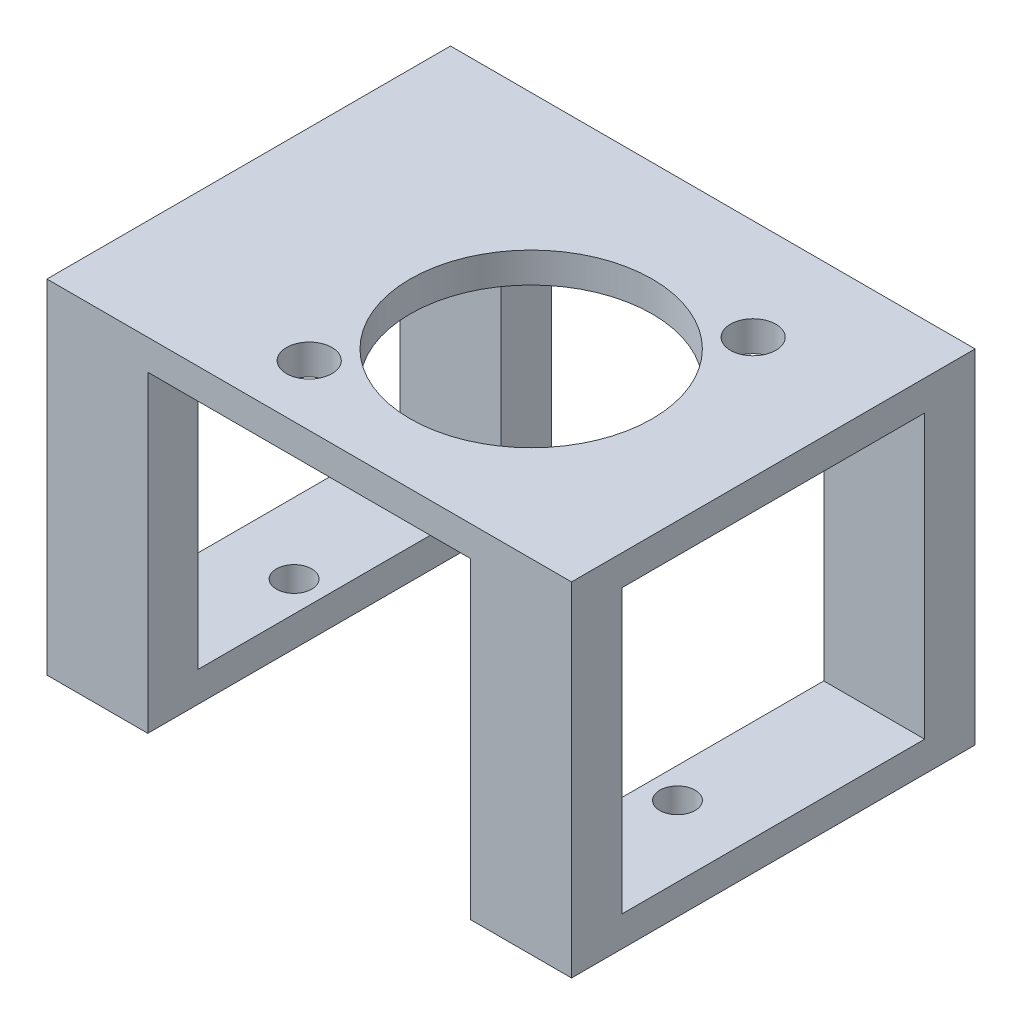
ISO-10303-21;
HEADER;
FILE_DESCRIPTION(('STEP AP214'),'2;1');
FILE_NAME('part.step','',(''),(''),'','','');
FILE_SCHEMA(('AUTOMOTIVE_DESIGN { 1 0 10303 214 1 1 1 1 }'));
ENDSEC;
DATA;
#1=APPLICATION_CONTEXT('core data for automotive mechanical design processes');
#2=APPLICATION_PROTOCOL_DEFINITION('international standard','automotive_design',2000,#1);
#3=PRODUCT_CONTEXT('',#1,'mechanical');
#4=PRODUCT('Part','Part','',(#3));
#5=PRODUCT_RELATED_PRODUCT_CATEGORY('part','',(#4));
#6=PRODUCT_DEFINITION_FORMATION('','',#4);
#7=PRODUCT_DEFINITION_CONTEXT('part definition',#1,'design');
#8=PRODUCT_DEFINITION('design','',#6,#7);
#9=PRODUCT_DEFINITION_SHAPE('','',#8);
#10=(LENGTH_UNIT() NAMED_UNIT(*) SI_UNIT(.MILLI.,.METRE.));
#11=(NAMED_UNIT(*) PLANE_ANGLE_UNIT() SI_UNIT($,.RADIAN.));
#12=(NAMED_UNIT(*) SI_UNIT($,.STERADIAN.) SOLID_ANGLE_UNIT());
#13=UNCERTAINTY_MEASURE_WITH_UNIT(LENGTH_MEASURE(1.E-05),#10,'distance_accuracy_value','');
#14=(GEOMETRIC_REPRESENTATION_CONTEXT(3) GLOBAL_UNCERTAINTY_ASSIGNED_CONTEXT((#13)) GLOBAL_UNIT_ASSIGNED_CONTEXT((#10,
#11,#12)) REPRESENTATION_CONTEXT('',''));
#15=CARTESIAN_POINT('',(0.,0.,0.));
#16=DIRECTION('',(0.,0.,1.));
#17=DIRECTION('',(1.,0.,0.));
#18=AXIS2_PLACEMENT_3D('',#15,#16,#17);
#19=CARTESIAN_POINT('',(0.,31.,0.));
#20=DIRECTION('',(0.,1.,0.));
#21=DIRECTION('',(0.,0.,1.));
#22=AXIS2_PLACEMENT_3D('',#19,#20,#21);
#23=PLANE('',#22);
#24=CARTESIAN_POINT('',(14.,31.,-12.5));
#25=DIRECTION('',(0.,1.,0.));
#26=DIRECTION('',(0.,0.,1.));
#27=AXIS2_PLACEMENT_3D('',#24,#25,#26);
#28=CIRCLE('',#27,2.25);
#29=CARTESIAN_POINT('',(14.,31.,-10.25));
#30=VERTEX_POINT('',#29);
#31=EDGE_CURVE('E237',#30,#30,#28,.F.);
#32=ORIENTED_EDGE('',*,*,#31,.F.);
#33=EDGE_LOOP('',(#32));
#34=FACE_BOUND('',#33,.T.);
#35=CARTESIAN_POINT('',(-6.,31.,11.5));
#36=DIRECTION('',(0.,1.,0.));
#37=DIRECTION('',(0.,0.,1.));
#38=AXIS2_PLACEMENT_3D('',#35,#36,#37);
#39=CIRCLE('',#38,2.25);
#40=CARTESIAN_POINT('',(-6.,31.,13.75));
#41=VERTEX_POINT('',#40);
#42=EDGE_CURVE('E238',#41,#41,#39,.F.);
#43=ORIENTED_EDGE('',*,*,#42,.F.);
#44=EDGE_LOOP('',(#43));
#45=FACE_BOUND('',#44,.T.);
#46=CARTESIAN_POINT('',(4.,31.,-0.499999999999994));
#47=DIRECTION('',(0.,1.,0.));
#48=DIRECTION('',(0.,0.,1.));
#49=AXIS2_PLACEMENT_3D('',#46,#47,#48);
#50=CIRCLE('',#49,12.);
#51=CARTESIAN_POINT('',(4.,31.,11.5));
#52=VERTEX_POINT('',#51);
#53=EDGE_CURVE('E257',#52,#52,#50,.F.);
#54=ORIENTED_EDGE('',*,*,#53,.F.);
#55=EDGE_LOOP('',(#54));
#56=FACE_BOUND('',#55,.T.);
#57=DIRECTION('',(0.,0.,1.));
#58=VECTOR('',#57,1.);
#59=CARTESIAN_POINT('',(16.,31.,17.5));
#60=LINE('',#59,#58);
#61=CARTESIAN_POINT('',(16.,31.,12.5));
#62=VERTEX_POINT('',#61);
#63=CARTESIAN_POINT('',(16.,31.,17.5));
#64=VERTEX_POINT('',#63);
#65=EDGE_CURVE('E157',#62,#64,#60,.T.);
#66=ORIENTED_EDGE('',*,*,#65,.T.);
#67=DIRECTION('',(1.,0.,0.));
#68=VECTOR('',#67,1.);
#69=CARTESIAN_POINT('',(-26.,31.,17.5));
#70=LINE('',#69,#68);
#71=CARTESIAN_POINT('',(-16.,31.,17.5));
#72=VERTEX_POINT('',#71);
#73=EDGE_CURVE('E311',#72,#64,#70,.T.);
#74=ORIENTED_EDGE('',*,*,#73,.F.);
#75=DIRECTION('',(0.,0.,-1.));
#76=VECTOR('',#75,1.);
#77=CARTESIAN_POINT('',(-16.,31.,17.5));
#78=LINE('',#77,#76);
#79=CARTESIAN_POINT('',(-16.,31.,12.5));
#80=VERTEX_POINT('',#79);
#81=EDGE_CURVE('E218',#72,#80,#78,.T.);
#82=ORIENTED_EDGE('',*,*,#81,.T.);
#83=DIRECTION('',(-1.,0.,0.));
#84=VECTOR('',#83,1.);
#85=CARTESIAN_POINT('',(-16.,31.,12.5));
#86=LINE('',#85,#84);
#87=CARTESIAN_POINT('',(-26.,31.,12.5));
#88=VERTEX_POINT('',#87);
#89=EDGE_CURVE('E222',#80,#88,#86,.T.);
#90=ORIENTED_EDGE('',*,*,#89,.T.);
#91=DIRECTION('',(0.,0.,1.));
#92=VECTOR('',#91,1.);
#93=CARTESIAN_POINT('',(-26.,31.,-22.5));
#94=LINE('',#93,#92);
#95=CARTESIAN_POINT('',(-26.,31.,-17.5));
#96=VERTEX_POINT('',#95);
#97=EDGE_CURVE('E291',#96,#88,#94,.T.);
#98=ORIENTED_EDGE('',*,*,#97,.F.);
#99=DIRECTION('',(-1.,0.,0.));
#100=VECTOR('',#99,1.);
#101=CARTESIAN_POINT('',(0.,31.,-17.5));
#102=LINE('',#101,#100);
#103=CARTESIAN_POINT('',(-16.,31.,-17.5));
#104=VERTEX_POINT('',#103);
#105=EDGE_CURVE('E324',#104,#96,#102,.T.);
#106=ORIENTED_EDGE('',*,*,#105,.F.);
#107=DIRECTION('',(0.,0.,-1.));
#108=VECTOR('',#107,1.);
#109=CARTESIAN_POINT('',(-16.,31.,0.));
#110=LINE('',#109,#108);
#111=CARTESIAN_POINT('',(-16.,31.,-22.5));
#112=VERTEX_POINT('',#111);
#113=EDGE_CURVE('E328',#104,#112,#110,.T.);
#114=ORIENTED_EDGE('',*,*,#113,.T.);
#115=DIRECTION('',(-1.,0.,0.));
#116=VECTOR('',#115,1.);
#117=CARTESIAN_POINT('',(-26.,31.,-22.5));
#118=LINE('',#117,#116);
#119=CARTESIAN_POINT('',(16.,31.,-22.5));
#120=VERTEX_POINT('',#119);
#121=EDGE_CURVE('E297',#120,#112,#118,.T.);
#122=ORIENTED_EDGE('',*,*,#121,.F.);
#123=DIRECTION('',(0.,0.,-1.));
#124=VECTOR('',#123,1.);
#125=CARTESIAN_POINT('',(16.,31.,0.));
#126=LINE('',#125,#124);
#127=CARTESIAN_POINT('',(16.,31.,-17.5));
#128=VERTEX_POINT('',#127);
#129=EDGE_CURVE('E265',#128,#120,#126,.T.);
#130=ORIENTED_EDGE('',*,*,#129,.F.);
#131=DIRECTION('',(1.,0.,0.));
#132=VECTOR('',#131,1.);
#133=CARTESIAN_POINT('',(0.,31.,-17.5));
#134=LINE('',#133,#132);
#135=CARTESIAN_POINT('',(26.,31.,-17.5));
#136=VERTEX_POINT('',#135);
#137=EDGE_CURVE('E262',#128,#136,#134,.T.);
#138=ORIENTED_EDGE('',*,*,#137,.T.);
#139=DIRECTION('',(0.,0.,-1.));
#140=VECTOR('',#139,1.);
#141=CARTESIAN_POINT('',(26.,31.,-22.5));
#142=LINE('',#141,#140);
#143=CARTESIAN_POINT('',(26.,31.,12.5));
#144=VERTEX_POINT('',#143);
#145=EDGE_CURVE('E177',#144,#136,#142,.T.);
#146=ORIENTED_EDGE('',*,*,#145,.F.);
#147=DIRECTION('',(-1.,0.,0.));
#148=VECTOR('',#147,1.);
#149=CARTESIAN_POINT('',(16.,31.,12.5));
#150=LINE('',#149,#148);
#151=EDGE_CURVE('E168',#144,#62,#150,.T.);
#152=ORIENTED_EDGE('',*,*,#151,.T.);
#153=EDGE_LOOP('',(#66,#74,#82,#90,#98,#106,#114,#122,#130,#138,#146,#152));
#154=FACE_BOUND('',#153,.T.);
#155=ADVANCED_FACE('F46',(#34,#45,#56,#154),#23,.F.);
#156=CARTESIAN_POINT('',(0.,3.,0.));
#157=DIRECTION('',(0.,1.,0.));
#158=DIRECTION('',(0.,0.,1.));
#159=AXIS2_PLACEMENT_3D('',#156,#157,#158);
#160=PLANE('',#159);
#161=CARTESIAN_POINT('',(19.,3.,0.));
#162=DIRECTION('',(0.,1.,0.));
#163=DIRECTION('',(0.,0.,1.));
#164=AXIS2_PLACEMENT_3D('',#161,#162,#163);
#165=CIRCLE('',#164,1.75);
#166=CARTESIAN_POINT('',(19.,3.,1.75));
#167=VERTEX_POINT('',#166);
#168=EDGE_CURVE('E189',#167,#167,#165,.T.);
#169=ORIENTED_EDGE('',*,*,#168,.F.);
#170=EDGE_LOOP('',(#169));
#171=FACE_BOUND('',#170,.T.);
#172=DIRECTION('',(0.,0.,-1.));
#173=VECTOR('',#172,1.);
#174=CARTESIAN_POINT('',(16.,3.,0.));
#175=LINE('',#174,#173);
#176=CARTESIAN_POINT('',(16.,3.,12.5));
#177=VERTEX_POINT('',#176);
#178=CARTESIAN_POINT('',(16.,3.,-17.5));
#179=VERTEX_POINT('',#178);
#180=EDGE_CURVE('E194',#177,#179,#175,.T.);
#181=ORIENTED_EDGE('',*,*,#180,.F.);
#182=DIRECTION('',(-1.,0.,0.));
#183=VECTOR('',#182,1.);
#184=CARTESIAN_POINT('',(16.,3.,12.5));
#185=LINE('',#184,#183);
#186=CARTESIAN_POINT('',(26.,3.,12.5));
#187=VERTEX_POINT('',#186);
#188=EDGE_CURVE('E172',#187,#177,#185,.T.);
#189=ORIENTED_EDGE('',*,*,#188,.F.);
#190=DIRECTION('',(0.,0.,-1.));
#191=VECTOR('',#190,1.);
#192=CARTESIAN_POINT('',(26.,3.,0.));
#193=LINE('',#192,#191);
#194=CARTESIAN_POINT('',(26.,3.,-17.5));
#195=VERTEX_POINT('',#194);
#196=EDGE_CURVE('E197',#187,#195,#193,.T.);
#197=ORIENTED_EDGE('',*,*,#196,.T.);
#198=DIRECTION('',(1.,0.,0.));
#199=VECTOR('',#198,1.);
#200=CARTESIAN_POINT('',(0.,3.,-17.5));
#201=LINE('',#200,#199);
#202=EDGE_CURVE('E200',#179,#195,#201,.T.);
#203=ORIENTED_EDGE('',*,*,#202,.F.);
#204=EDGE_LOOP('',(#181,#189,#197,#203));
#205=FACE_BOUND('',#204,.T.);
#206=ADVANCED_FACE('F407',(#171,#205),#160,.T.);
#207=CARTESIAN_POINT('',(0.,3.,0.));
#208=DIRECTION('',(0.,1.,0.));
#209=DIRECTION('',(0.,0.,1.));
#210=AXIS2_PLACEMENT_3D('',#207,#208,#209);
#211=PLANE('',#210);
#212=CARTESIAN_POINT('',(-19.,3.,0.));
#213=DIRECTION('',(0.,1.,0.));
#214=DIRECTION('',(0.,0.,1.));
#215=AXIS2_PLACEMENT_3D('',#212,#213,#214);
#216=CIRCLE('',#215,1.75);
#217=CARTESIAN_POINT('',(-19.,3.,1.75000000000001));
#218=VERTEX_POINT('',#217);
#219=EDGE_CURVE('E226',#218,#218,#216,.T.);
#220=ORIENTED_EDGE('',*,*,#219,.F.);
#221=EDGE_LOOP('',(#220));
#222=FACE_BOUND('',#221,.T.);
#223=DIRECTION('',(0.,0.,-1.));
#224=VECTOR('',#223,1.);
#225=CARTESIAN_POINT('',(-26.,3.,0.));
#226=LINE('',#225,#224);
#227=CARTESIAN_POINT('',(-26.,3.,12.5));
#228=VERTEX_POINT('',#227);
#229=CARTESIAN_POINT('',(-26.,3.,-17.5));
#230=VERTEX_POINT('',#229);
#231=EDGE_CURVE('E352',#228,#230,#226,.T.);
#232=ORIENTED_EDGE('',*,*,#231,.F.);
#233=DIRECTION('',(-1.,0.,0.));
#234=VECTOR('',#233,1.);
#235=CARTESIAN_POINT('',(-16.,3.,12.5));
#236=LINE('',#235,#234);
#237=CARTESIAN_POINT('',(-16.,3.,12.5));
#238=VERTEX_POINT('',#237);
#239=EDGE_CURVE('E209',#238,#228,#236,.T.);
#240=ORIENTED_EDGE('',*,*,#239,.F.);
#241=DIRECTION('',(0.,0.,-1.));
#242=VECTOR('',#241,1.);
#243=CARTESIAN_POINT('',(-16.,3.,0.));
#244=LINE('',#243,#242);
#245=CARTESIAN_POINT('',(-16.,3.,-17.5));
#246=VERTEX_POINT('',#245);
#247=EDGE_CURVE('E355',#238,#246,#244,.T.);
#248=ORIENTED_EDGE('',*,*,#247,.T.);
#249=DIRECTION('',(-1.,0.,0.));
#250=VECTOR('',#249,1.);
#251=CARTESIAN_POINT('',(0.,3.,-17.5));
#252=LINE('',#251,#250);
#253=EDGE_CURVE('E359',#246,#230,#252,.T.);
#254=ORIENTED_EDGE('',*,*,#253,.T.);
#255=EDGE_LOOP('',(#232,#240,#248,#254));
#256=FACE_BOUND('',#255,.T.);
#257=ADVANCED_FACE('F396',(#222,#256),#211,.T.);
#258=CARTESIAN_POINT('',(-26.,3.,0.));
#259=DIRECTION('',(-1.,0.,0.));
#260=DIRECTION('',(0.,0.,1.));
#261=AXIS2_PLACEMENT_3D('',#258,#259,#260);
#262=PLANE('',#261);
#263=DIRECTION('',(0.,-1.,0.));
#264=VECTOR('',#263,1.);
#265=CARTESIAN_POINT('',(-26.,3.,17.5));
#266=LINE('',#265,#264);
#267=CARTESIAN_POINT('',(-26.,34.,17.5));
#268=VERTEX_POINT('',#267);
#269=CARTESIAN_POINT('',(-26.,0.,17.5));
#270=VERTEX_POINT('',#269);
#271=EDGE_CURVE('E11',#268,#270,#266,.T.);
#272=ORIENTED_EDGE('',*,*,#271,.F.);
#273=DIRECTION('',(0.,0.,1.));
#274=VECTOR('',#273,1.);
#275=CARTESIAN_POINT('',(-26.,34.,-22.5));
#276=LINE('',#275,#274);
#277=CARTESIAN_POINT('',(-26.,34.,-22.5));
#278=VERTEX_POINT('',#277);
#279=EDGE_CURVE('E292',#278,#268,#276,.T.);
#280=ORIENTED_EDGE('',*,*,#279,.F.);
#281=DIRECTION('',(0.,-1.,0.));
#282=VECTOR('',#281,1.);
#283=CARTESIAN_POINT('',(-26.,31.,-22.5));
#284=LINE('',#283,#282);
#285=CARTESIAN_POINT('',(-26.,0.,-22.5));
#286=VERTEX_POINT('',#285);
#287=EDGE_CURVE('E332',#278,#286,#284,.T.);
#288=ORIENTED_EDGE('',*,*,#287,.T.);
#289=DIRECTION('',(0.,0.,-1.));
#290=VECTOR('',#289,1.);
#291=CARTESIAN_POINT('',(-26.,0.,0.));
#292=LINE('',#291,#290);
#293=EDGE_CURVE('E351',#270,#286,#292,.T.);
#294=ORIENTED_EDGE('',*,*,#293,.F.);
#295=EDGE_LOOP('',(#272,#280,#288,#294));
#296=FACE_BOUND('',#295,.T.);
#297=ORIENTED_EDGE('',*,*,#97,.T.);
#298=DIRECTION('',(0.,-1.,0.));
#299=VECTOR('',#298,1.);
#300=CARTESIAN_POINT('',(-26.,34.002,12.5));
#301=LINE('',#300,#299);
#302=EDGE_CURVE('E213',#88,#228,#301,.T.);
#303=ORIENTED_EDGE('',*,*,#302,.T.);
#304=ORIENTED_EDGE('',*,*,#231,.T.);
#305=DIRECTION('',(0.,-1.,0.));
#306=VECTOR('',#305,1.);
#307=CARTESIAN_POINT('',(-26.,31.,-17.5));
#308=LINE('',#307,#306);
#309=EDGE_CURVE('E347',#96,#230,#308,.T.);
#310=ORIENTED_EDGE('',*,*,#309,.F.);
#311=EDGE_LOOP('',(#297,#303,#304,#310));
#312=FACE_BOUND('',#311,.T.);
#313=ADVANCED_FACE('F48',(#296,#312),#262,.T.);
#314=CARTESIAN_POINT('',(0.,3.,17.5));
#315=DIRECTION('',(0.,0.,-1.));
#316=DIRECTION('',(-1.,0.,0.));
#317=AXIS2_PLACEMENT_3D('',#314,#315,#316);
#318=PLANE('',#317);
#319=DIRECTION('',(1.,0.,0.));
#320=VECTOR('',#319,1.);
#321=CARTESIAN_POINT('',(0.,0.,17.5));
#322=LINE('',#321,#320);
#323=CARTESIAN_POINT('',(-16.,0.,17.5));
#324=VERTEX_POINT('',#323);
#325=EDGE_CURVE('E365',#270,#324,#322,.T.);
#326=ORIENTED_EDGE('',*,*,#325,.T.);
#327=DIRECTION('',(0.,-1.,0.));
#328=VECTOR('',#327,1.);
#329=CARTESIAN_POINT('',(-16.,3.,17.5));
#330=LINE('',#329,#328);
#331=EDGE_CURVE('E55',#72,#324,#330,.T.);
#332=ORIENTED_EDGE('',*,*,#331,.F.);
#333=ORIENTED_EDGE('',*,*,#73,.T.);
#334=DIRECTION('',(0.,-1.,0.));
#335=VECTOR('',#334,1.);
#336=CARTESIAN_POINT('',(16.,3.,17.5));
#337=LINE('',#336,#335);
#338=CARTESIAN_POINT('',(16.,0.,17.5));
#339=VERTEX_POINT('',#338);
#340=EDGE_CURVE('E162',#64,#339,#337,.T.);
#341=ORIENTED_EDGE('',*,*,#340,.T.);
#342=DIRECTION('',(1.,0.,0.));
#343=VECTOR('',#342,1.);
#344=CARTESIAN_POINT('',(0.,0.,17.5));
#345=LINE('',#344,#343);
#346=CARTESIAN_POINT('',(26.,0.,17.5));
#347=VERTEX_POINT('',#346);
#348=EDGE_CURVE('E193',#339,#347,#345,.T.);
#349=ORIENTED_EDGE('',*,*,#348,.T.);
#350=DIRECTION('',(0.,-1.,0.));
#351=VECTOR('',#350,1.);
#352=CARTESIAN_POINT('',(26.,34.,17.5));
#353=LINE('',#352,#351);
#354=CARTESIAN_POINT('',(26.,34.,17.5));
#355=VERTEX_POINT('',#354);
#356=EDGE_CURVE('E320',#355,#347,#353,.T.);
#357=ORIENTED_EDGE('',*,*,#356,.F.);
#358=DIRECTION('',(1.,0.,0.));
#359=VECTOR('',#358,1.);
#360=CARTESIAN_POINT('',(-26.,34.,17.5));
#361=LINE('',#360,#359);
#362=EDGE_CURVE('E296',#268,#355,#361,.T.);
#363=ORIENTED_EDGE('',*,*,#362,.F.);
#364=ORIENTED_EDGE('',*,*,#271,.T.);
#365=EDGE_LOOP('',(#326,#332,#333,#341,#349,#357,#363,#364));
#366=FACE_BOUND('',#365,.T.);
#367=ADVANCED_FACE('F401',(#366),#318,.F.);
#368=CARTESIAN_POINT('',(-16.,3.,0.));
#369=DIRECTION('',(-1.,0.,0.));
#370=DIRECTION('',(0.,0.,1.));
#371=AXIS2_PLACEMENT_3D('',#368,#369,#370);
#372=PLANE('',#371);
#373=DIRECTION('',(0.,0.,-1.));
#374=VECTOR('',#373,1.);
#375=CARTESIAN_POINT('',(-16.,0.,0.));
#376=LINE('',#375,#374);
#377=CARTESIAN_POINT('',(-16.,0.,-22.5));
#378=VERTEX_POINT('',#377);
#379=EDGE_CURVE('E356',#324,#378,#376,.T.);
#380=ORIENTED_EDGE('',*,*,#379,.T.);
#381=DIRECTION('',(0.,-1.,0.));
#382=VECTOR('',#381,1.);
#383=CARTESIAN_POINT('',(-16.,31.,-22.5));
#384=LINE('',#383,#382);
#385=EDGE_CURVE('E339',#112,#378,#384,.T.);
#386=ORIENTED_EDGE('',*,*,#385,.F.);
#387=ORIENTED_EDGE('',*,*,#113,.F.);
#388=DIRECTION('',(0.,-1.,0.));
#389=VECTOR('',#388,1.);
#390=CARTESIAN_POINT('',(-16.,31.,-17.5));
#391=LINE('',#390,#389);
#392=EDGE_CURVE('E343',#104,#246,#391,.T.);
#393=ORIENTED_EDGE('',*,*,#392,.T.);
#394=ORIENTED_EDGE('',*,*,#247,.F.);
#395=DIRECTION('',(0.,-1.,0.));
#396=VECTOR('',#395,1.);
#397=CARTESIAN_POINT('',(-16.,34.002,12.5));
#398=LINE('',#397,#396);
#399=EDGE_CURVE('E214',#80,#238,#398,.T.);
#400=ORIENTED_EDGE('',*,*,#399,.F.);
#401=ORIENTED_EDGE('',*,*,#81,.F.);
#402=ORIENTED_EDGE('',*,*,#331,.T.);
#403=EDGE_LOOP('',(#380,#386,#387,#393,#394,#400,#401,#402));
#404=FACE_BOUND('',#403,.T.);
#405=ADVANCED_FACE('F374',(#404),#372,.F.);
#406=CARTESIAN_POINT('',(0.,0.,0.));
#407=DIRECTION('',(0.,1.,0.));
#408=DIRECTION('',(0.,0.,1.));
#409=AXIS2_PLACEMENT_3D('',#406,#407,#408);
#410=PLANE('',#409);
#411=CARTESIAN_POINT('',(-19.,0.,0.));
#412=DIRECTION('',(0.,1.,0.));
#413=DIRECTION('',(0.,0.,1.));
#414=AXIS2_PLACEMENT_3D('',#411,#412,#413);
#415=CIRCLE('',#414,1.75);
#416=CARTESIAN_POINT('',(-19.,0.,1.75000000000001));
#417=VERTEX_POINT('',#416);
#418=EDGE_CURVE('E233',#417,#417,#415,.F.);
#419=ORIENTED_EDGE('',*,*,#418,.F.);
#420=EDGE_LOOP('',(#419));
#421=FACE_BOUND('',#420,.T.);
#422=ORIENTED_EDGE('',*,*,#293,.T.);
#423=DIRECTION('',(-1.,0.,0.));
#424=VECTOR('',#423,1.);
#425=CARTESIAN_POINT('',(0.,0.,-22.5));
#426=LINE('',#425,#424);
#427=EDGE_CURVE('E323',#378,#286,#426,.T.);
#428=ORIENTED_EDGE('',*,*,#427,.F.);
#429=ORIENTED_EDGE('',*,*,#379,.F.);
#430=ORIENTED_EDGE('',*,*,#325,.F.);
#431=EDGE_LOOP('',(#422,#428,#429,#430));
#432=FACE_BOUND('',#431,.T.);
#433=ADVANCED_FACE('F381',(#421,#432),#410,.F.);
#434=CARTESIAN_POINT('',(0.,31.,-17.5));
#435=DIRECTION('',(0.,0.,1.));
#436=DIRECTION('',(1.,0.,0.));
#437=AXIS2_PLACEMENT_3D('',#434,#435,#436);
#438=PLANE('',#437);
#439=ORIENTED_EDGE('',*,*,#253,.F.);
#440=ORIENTED_EDGE('',*,*,#392,.F.);
#441=ORIENTED_EDGE('',*,*,#105,.T.);
#442=ORIENTED_EDGE('',*,*,#309,.T.);
#443=EDGE_LOOP('',(#439,#440,#441,#442));
#444=FACE_BOUND('',#443,.T.);
#445=ADVANCED_FACE('F393',(#444),#438,.T.);
#446=CARTESIAN_POINT('',(0.,31.,-22.5));
#447=DIRECTION('',(0.,0.,1.));
#448=DIRECTION('',(1.,0.,0.));
#449=AXIS2_PLACEMENT_3D('',#446,#447,#448);
#450=PLANE('',#449);
#451=ORIENTED_EDGE('',*,*,#427,.T.);
#452=ORIENTED_EDGE('',*,*,#287,.F.);
#453=DIRECTION('',(-1.,0.,0.));
#454=VECTOR('',#453,1.);
#455=CARTESIAN_POINT('',(-26.,34.,-22.5));
#456=LINE('',#455,#454);
#457=CARTESIAN_POINT('',(26.,34.,-22.5));
#458=VERTEX_POINT('',#457);
#459=EDGE_CURVE('E303',#458,#278,#456,.T.);
#460=ORIENTED_EDGE('',*,*,#459,.F.);
#461=DIRECTION('',(0.,-1.,0.));
#462=VECTOR('',#461,1.);
#463=CARTESIAN_POINT('',(26.,34.,-22.5));
#464=LINE('',#463,#462);
#465=CARTESIAN_POINT('',(26.,0.,-22.5));
#466=VERTEX_POINT('',#465);
#467=EDGE_CURVE('E307',#458,#466,#464,.T.);
#468=ORIENTED_EDGE('',*,*,#467,.T.);
#469=DIRECTION('',(1.,0.,0.));
#470=VECTOR('',#469,1.);
#471=CARTESIAN_POINT('',(0.,0.,-22.5));
#472=LINE('',#471,#470);
#473=CARTESIAN_POINT('',(16.,0.,-22.5));
#474=VERTEX_POINT('',#473);
#475=EDGE_CURVE('E274',#474,#466,#472,.T.);
#476=ORIENTED_EDGE('',*,*,#475,.F.);
#477=DIRECTION('',(0.,-1.,0.));
#478=VECTOR('',#477,1.);
#479=CARTESIAN_POINT('',(16.,31.,-22.5));
#480=LINE('',#479,#478);
#481=EDGE_CURVE('E284',#120,#474,#480,.T.);
#482=ORIENTED_EDGE('',*,*,#481,.F.);
#483=ORIENTED_EDGE('',*,*,#121,.T.);
#484=ORIENTED_EDGE('',*,*,#385,.T.);
#485=EDGE_LOOP('',(#451,#452,#460,#468,#476,#482,#483,#484));
#486=FACE_BOUND('',#485,.T.);
#487=ADVANCED_FACE('F384',(#486),#450,.F.);
#488=CARTESIAN_POINT('',(26.,34.,-22.5));
#489=DIRECTION('',(-1.,0.,0.));
#490=DIRECTION('',(0.,0.,1.));
#491=AXIS2_PLACEMENT_3D('',#488,#489,#490);
#492=PLANE('',#491);
#493=DIRECTION('',(0.,-1.,0.));
#494=VECTOR('',#493,1.);
#495=CARTESIAN_POINT('',(26.,34.002,12.5));
#496=LINE('',#495,#494);
#497=EDGE_CURVE('E62',#144,#187,#496,.T.);
#498=ORIENTED_EDGE('',*,*,#497,.F.);
#499=ORIENTED_EDGE('',*,*,#145,.T.);
#500=DIRECTION('',(0.,-1.,0.));
#501=VECTOR('',#500,1.);
#502=CARTESIAN_POINT('',(26.,31.,-17.5));
#503=LINE('',#502,#501);
#504=EDGE_CURVE('E287',#136,#195,#503,.T.);
#505=ORIENTED_EDGE('',*,*,#504,.T.);
#506=ORIENTED_EDGE('',*,*,#196,.F.);
#507=EDGE_LOOP('',(#498,#499,#505,#506));
#508=FACE_BOUND('',#507,.T.);
#509=ORIENTED_EDGE('',*,*,#356,.T.);
#510=DIRECTION('',(0.,0.,-1.));
#511=VECTOR('',#510,1.);
#512=CARTESIAN_POINT('',(26.,0.,0.));
#513=LINE('',#512,#511);
#514=EDGE_CURVE('E261',#347,#466,#513,.T.);
#515=ORIENTED_EDGE('',*,*,#514,.T.);
#516=ORIENTED_EDGE('',*,*,#467,.F.);
#517=DIRECTION('',(0.,0.,-1.));
#518=VECTOR('',#517,1.);
#519=CARTESIAN_POINT('',(26.,34.,-22.5));
#520=LINE('',#519,#518);
#521=EDGE_CURVE('E300',#355,#458,#520,.T.);
#522=ORIENTED_EDGE('',*,*,#521,.F.);
#523=EDGE_LOOP('',(#509,#515,#516,#522));
#524=FACE_BOUND('',#523,.T.);
#525=ADVANCED_FACE('F424',(#508,#524),#492,.F.);
#526=CARTESIAN_POINT('',(0.,34.,0.));
#527=DIRECTION('',(0.,1.,0.));
#528=DIRECTION('',(0.,0.,1.));
#529=AXIS2_PLACEMENT_3D('',#526,#527,#528);
#530=PLANE('',#529);
#531=CARTESIAN_POINT('',(14.,34.,-12.5));
#532=DIRECTION('',(0.,1.,0.));
#533=DIRECTION('',(0.,0.,1.));
#534=AXIS2_PLACEMENT_3D('',#531,#532,#533);
#535=CIRCLE('',#534,2.25);
#536=CARTESIAN_POINT('',(14.,34.,-10.25));
#537=VERTEX_POINT('',#536);
#538=EDGE_CURVE('E243',#537,#537,#535,.T.);
#539=ORIENTED_EDGE('',*,*,#538,.F.);
#540=EDGE_LOOP('',(#539));
#541=FACE_BOUND('',#540,.T.);
#542=CARTESIAN_POINT('',(-6.,34.,11.5));
#543=DIRECTION('',(0.,1.,0.));
#544=DIRECTION('',(0.,0.,1.));
#545=AXIS2_PLACEMENT_3D('',#542,#543,#544);
#546=CIRCLE('',#545,2.25);
#547=CARTESIAN_POINT('',(-6.,34.,13.75));
#548=VERTEX_POINT('',#547);
#549=EDGE_CURVE('E242',#548,#548,#546,.T.);
#550=ORIENTED_EDGE('',*,*,#549,.F.);
#551=EDGE_LOOP('',(#550));
#552=FACE_BOUND('',#551,.T.);
#553=CARTESIAN_POINT('',(4.,34.,-0.499999999999994));
#554=DIRECTION('',(0.,1.,0.));
#555=DIRECTION('',(0.,0.,1.));
#556=AXIS2_PLACEMENT_3D('',#553,#554,#555);
#557=CIRCLE('',#556,12.);
#558=CARTESIAN_POINT('',(4.,34.,11.5));
#559=VERTEX_POINT('',#558);
#560=EDGE_CURVE('E247',#559,#559,#557,.T.);
#561=ORIENTED_EDGE('',*,*,#560,.F.);
#562=EDGE_LOOP('',(#561));
#563=FACE_BOUND('',#562,.T.);
#564=ORIENTED_EDGE('',*,*,#279,.T.);
#565=ORIENTED_EDGE('',*,*,#362,.T.);
#566=ORIENTED_EDGE('',*,*,#521,.T.);
#567=ORIENTED_EDGE('',*,*,#459,.T.);
#568=EDGE_LOOP('',(#564,#565,#566,#567));
#569=FACE_BOUND('',#568,.T.);
#570=ADVANCED_FACE('F422',(#541,#552,#563,#569),#530,.T.);
#571=CARTESIAN_POINT('',(0.,31.,-17.5));
#572=DIRECTION('',(0.,0.,-1.));
#573=DIRECTION('',(-1.,0.,0.));
#574=AXIS2_PLACEMENT_3D('',#571,#572,#573);
#575=PLANE('',#574);
#576=DIRECTION('',(0.,-1.,0.));
#577=VECTOR('',#576,1.);
#578=CARTESIAN_POINT('',(16.,31.,-17.5));
#579=LINE('',#578,#577);
#580=EDGE_CURVE('E270',#128,#179,#579,.T.);
#581=ORIENTED_EDGE('',*,*,#580,.T.);
#582=ORIENTED_EDGE('',*,*,#202,.T.);
#583=ORIENTED_EDGE('',*,*,#504,.F.);
#584=ORIENTED_EDGE('',*,*,#137,.F.);
#585=EDGE_LOOP('',(#581,#582,#583,#584));
#586=FACE_BOUND('',#585,.T.);
#587=ADVANCED_FACE('F464',(#586),#575,.F.);
#588=CARTESIAN_POINT('',(16.,31.,0.));
#589=DIRECTION('',(-1.,0.,0.));
#590=DIRECTION('',(0.,0.,1.));
#591=AXIS2_PLACEMENT_3D('',#588,#589,#590);
#592=PLANE('',#591);
#593=DIRECTION('',(0.,0.,-1.));
#594=VECTOR('',#593,1.);
#595=CARTESIAN_POINT('',(16.,0.,0.));
#596=LINE('',#595,#594);
#597=EDGE_CURVE('E266',#339,#474,#596,.T.);
#598=ORIENTED_EDGE('',*,*,#597,.F.);
#599=ORIENTED_EDGE('',*,*,#340,.F.);
#600=ORIENTED_EDGE('',*,*,#65,.F.);
#601=DIRECTION('',(0.,-1.,0.));
#602=VECTOR('',#601,1.);
#603=CARTESIAN_POINT('',(16.,34.002,12.5));
#604=LINE('',#603,#602);
#605=EDGE_CURVE('E160',#62,#177,#604,.T.);
#606=ORIENTED_EDGE('',*,*,#605,.T.);
#607=ORIENTED_EDGE('',*,*,#180,.T.);
#608=ORIENTED_EDGE('',*,*,#580,.F.);
#609=ORIENTED_EDGE('',*,*,#129,.T.);
#610=ORIENTED_EDGE('',*,*,#481,.T.);
#611=EDGE_LOOP('',(#598,#599,#600,#606,#607,#608,#609,#610));
#612=FACE_BOUND('',#611,.T.);
#613=ADVANCED_FACE('F159',(#612),#592,.T.);
#614=CARTESIAN_POINT('',(0.,0.,0.));
#615=DIRECTION('',(0.,1.,0.));
#616=DIRECTION('',(0.,0.,1.));
#617=AXIS2_PLACEMENT_3D('',#614,#615,#616);
#618=PLANE('',#617);
#619=ORIENTED_EDGE('',*,*,#514,.F.);
#620=ORIENTED_EDGE('',*,*,#348,.F.);
#621=ORIENTED_EDGE('',*,*,#597,.T.);
#622=ORIENTED_EDGE('',*,*,#475,.T.);
#623=EDGE_LOOP('',(#619,#620,#621,#622));
#624=FACE_BOUND('',#623,.T.);
#625=CARTESIAN_POINT('',(19.,0.,0.));
#626=DIRECTION('',(0.,1.,0.));
#627=DIRECTION('',(0.,0.,1.));
#628=AXIS2_PLACEMENT_3D('',#625,#626,#627);
#629=CIRCLE('',#628,1.75);
#630=CARTESIAN_POINT('',(19.,0.,1.75));
#631=VERTEX_POINT('',#630);
#632=EDGE_CURVE('E185',#631,#631,#629,.F.);
#633=ORIENTED_EDGE('',*,*,#632,.F.);
#634=EDGE_LOOP('',(#633));
#635=FACE_BOUND('',#634,.T.);
#636=ADVANCED_FACE('F477',(#624,#635),#618,.F.);
#637=CARTESIAN_POINT('',(4.,-0.001000000000001,-0.499999999999994));
#638=DIRECTION('',(0.,1.,0.));
#639=DIRECTION('',(0.,0.,1.));
#640=AXIS2_PLACEMENT_3D('',#637,#638,#639);
#641=CYLINDRICAL_SURFACE('',#640,12.);
#642=ORIENTED_EDGE('',*,*,#560,.T.);
#643=EDGE_LOOP('',(#642));
#644=FACE_BOUND('',#643,.T.);
#645=ORIENTED_EDGE('',*,*,#53,.T.);
#646=EDGE_LOOP('',(#645));
#647=FACE_BOUND('',#646,.T.);
#648=ADVANCED_FACE('F484',(#644,#647),#641,.F.);
#649=CARTESIAN_POINT('',(-6.,-0.001000000000001,11.5));
#650=DIRECTION('',(0.,1.,0.));
#651=DIRECTION('',(0.,0.,1.));
#652=AXIS2_PLACEMENT_3D('',#649,#650,#651);
#653=CYLINDRICAL_SURFACE('',#652,2.25);
#654=ORIENTED_EDGE('',*,*,#549,.T.);
#655=EDGE_LOOP('',(#654));
#656=FACE_BOUND('',#655,.T.);
#657=ORIENTED_EDGE('',*,*,#42,.T.);
#658=EDGE_LOOP('',(#657));
#659=FACE_BOUND('',#658,.T.);
#660=ADVANCED_FACE('F492',(#656,#659),#653,.F.);
#661=CARTESIAN_POINT('',(14.,-0.001000000000001,-12.5));
#662=DIRECTION('',(0.,1.,0.));
#663=DIRECTION('',(0.,0.,1.));
#664=AXIS2_PLACEMENT_3D('',#661,#662,#663);
#665=CYLINDRICAL_SURFACE('',#664,2.25);
#666=ORIENTED_EDGE('',*,*,#538,.T.);
#667=EDGE_LOOP('',(#666));
#668=FACE_BOUND('',#667,.T.);
#669=ORIENTED_EDGE('',*,*,#31,.T.);
#670=EDGE_LOOP('',(#669));
#671=FACE_BOUND('',#670,.T.);
#672=ADVANCED_FACE('F500',(#668,#671),#665,.F.);
#673=CARTESIAN_POINT('',(-19.,-0.00100000000000013,0.));
#674=DIRECTION('',(0.,1.,0.));
#675=DIRECTION('',(0.,0.,1.));
#676=AXIS2_PLACEMENT_3D('',#673,#674,#675);
#677=CYLINDRICAL_SURFACE('',#676,1.75);
#678=ORIENTED_EDGE('',*,*,#219,.T.);
#679=EDGE_LOOP('',(#678));
#680=FACE_BOUND('',#679,.T.);
#681=ORIENTED_EDGE('',*,*,#418,.T.);
#682=EDGE_LOOP('',(#681));
#683=FACE_BOUND('',#682,.T.);
#684=ADVANCED_FACE('F507',(#680,#683),#677,.F.);
#685=CARTESIAN_POINT('',(-16.,34.002,12.5));
#686=DIRECTION('',(0.,0.,1.));
#687=DIRECTION('',(1.,0.,0.));
#688=AXIS2_PLACEMENT_3D('',#685,#686,#687);
#689=PLANE('',#688);
#690=ORIENTED_EDGE('',*,*,#89,.F.);
#691=ORIENTED_EDGE('',*,*,#399,.T.);
#692=ORIENTED_EDGE('',*,*,#239,.T.);
#693=ORIENTED_EDGE('',*,*,#302,.F.);
#694=EDGE_LOOP('',(#690,#691,#692,#693));
#695=FACE_BOUND('',#694,.T.);
#696=ADVANCED_FACE('F398',(#695),#689,.F.);
#697=CARTESIAN_POINT('',(19.,-0.00100000000000013,0.));
#698=DIRECTION('',(0.,1.,0.));
#699=DIRECTION('',(0.,0.,1.));
#700=AXIS2_PLACEMENT_3D('',#697,#698,#699);
#701=CYLINDRICAL_SURFACE('',#700,1.75);
#702=ORIENTED_EDGE('',*,*,#168,.T.);
#703=EDGE_LOOP('',(#702));
#704=FACE_BOUND('',#703,.T.);
#705=ORIENTED_EDGE('',*,*,#632,.T.);
#706=EDGE_LOOP('',(#705));
#707=FACE_BOUND('',#706,.T.);
#708=ADVANCED_FACE('F520',(#704,#707),#701,.F.);
#709=CARTESIAN_POINT('',(16.,34.002,12.5));
#710=DIRECTION('',(0.,0.,1.));
#711=DIRECTION('',(1.,0.,0.));
#712=AXIS2_PLACEMENT_3D('',#709,#710,#711);
#713=PLANE('',#712);
#714=ORIENTED_EDGE('',*,*,#151,.F.);
#715=ORIENTED_EDGE('',*,*,#497,.T.);
#716=ORIENTED_EDGE('',*,*,#188,.T.);
#717=ORIENTED_EDGE('',*,*,#605,.F.);
#718=EDGE_LOOP('',(#714,#715,#716,#717));
#719=FACE_BOUND('',#718,.T.);
#720=ADVANCED_FACE('F170',(#719),#713,.F.);
#721=CLOSED_SHELL('',(#155,#206,#257,#313,#367,#405,#433,#445,#487,#525,#570,#587,#613,#636,
#648,#660,#672,#684,#696,#708,#720));
#722=MANIFOLD_SOLID_BREP('B2',#721);
#723=ADVANCED_BREP_SHAPE_REPRESENTATION('',(#18,#722),#14);
#724=SHAPE_DEFINITION_REPRESENTATION(#9,#723);
ENDSEC;
END-ISO-10303-21;
